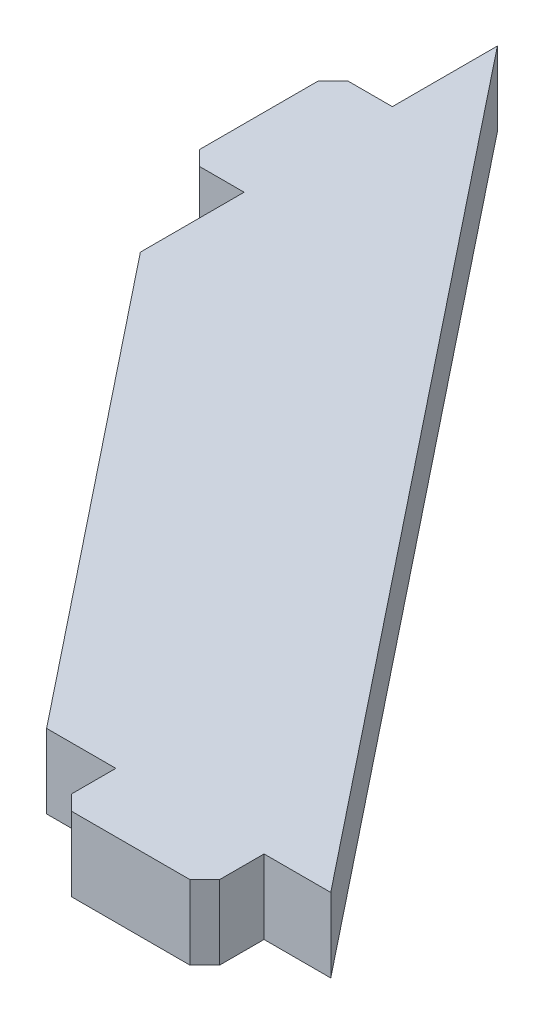
ISO-10303-21;
HEADER;
FILE_DESCRIPTION(('STEP AP214'),'2;1');
FILE_NAME('part.step','',(''),(''),'','','');
FILE_SCHEMA(('AUTOMOTIVE_DESIGN { 1 0 10303 214 1 1 1 1 }'));
ENDSEC;
DATA;
#1=APPLICATION_CONTEXT('core data for automotive mechanical design processes');
#2=APPLICATION_PROTOCOL_DEFINITION('international standard','automotive_design',2000,#1);
#3=PRODUCT_CONTEXT('',#1,'mechanical');
#4=PRODUCT('Part','Part','',(#3));
#5=PRODUCT_RELATED_PRODUCT_CATEGORY('part','',(#4));
#6=PRODUCT_DEFINITION_FORMATION('','',#4);
#7=PRODUCT_DEFINITION_CONTEXT('part definition',#1,'design');
#8=PRODUCT_DEFINITION('design','',#6,#7);
#9=PRODUCT_DEFINITION_SHAPE('','',#8);
#10=(LENGTH_UNIT() NAMED_UNIT(*) SI_UNIT(.MILLI.,.METRE.));
#11=(NAMED_UNIT(*) PLANE_ANGLE_UNIT() SI_UNIT($,.RADIAN.));
#12=(NAMED_UNIT(*) SI_UNIT($,.STERADIAN.) SOLID_ANGLE_UNIT());
#13=UNCERTAINTY_MEASURE_WITH_UNIT(LENGTH_MEASURE(1.E-05),#10,'distance_accuracy_value','');
#14=(GEOMETRIC_REPRESENTATION_CONTEXT(3) GLOBAL_UNCERTAINTY_ASSIGNED_CONTEXT((#13)) GLOBAL_UNIT_ASSIGNED_CONTEXT((#10,
#11,#12)) REPRESENTATION_CONTEXT('',''));
#15=CARTESIAN_POINT('',(0.,0.,0.));
#16=DIRECTION('',(0.,0.,1.));
#17=DIRECTION('',(1.,0.,0.));
#18=AXIS2_PLACEMENT_3D('',#15,#16,#17);
#19=CARTESIAN_POINT('',(-58.5,22.4999999999997,-9.34090909090911));
#20=DIRECTION('',(1.,0.,0.));
#21=DIRECTION('',(0.,0.,1.));
#22=AXIS2_PLACEMENT_3D('',#19,#20,#21);
#23=PLANE('',#22);
#24=DIRECTION('',(0.,0.,1.));
#25=VECTOR('',#24,1.);
#26=CARTESIAN_POINT('',(-58.5,22.4999999999997,-9.34090909090911));
#27=LINE('',#26,#25);
#28=CARTESIAN_POINT('',(-58.5000000000003,22.5,-75.9806956016062));
#29=VERTEX_POINT('',#28);
#30=CARTESIAN_POINT('',(-58.5000000000004,22.5,-61.9806956016062));
#31=VERTEX_POINT('',#30);
#32=EDGE_CURVE('E178',#29,#31,#27,.T.);
#33=ORIENTED_EDGE('',*,*,#32,.F.);
#34=CARTESIAN_POINT('',(-58.5000000000003,22.5,-75.9806956016062));
#35=CARTESIAN_POINT('',(-58.5000000000003,12.5,-75.9806956016062));
#36=B_SPLINE_CURVE_WITH_KNOTS('',1,(#34,#35),.UNSPECIFIED.,.F.,.F.,(2,2),(0.,0.166666666666667),.UNSPECIFIED.);
#37=CARTESIAN_POINT('',(-58.5000000000003,12.5,-75.9806956016062));
#38=VERTEX_POINT('',#37);
#39=EDGE_CURVE('E163',#29,#38,#36,.T.);
#40=ORIENTED_EDGE('',*,*,#39,.T.);
#41=DIRECTION('',(0.,0.,1.));
#42=VECTOR('',#41,1.);
#43=CARTESIAN_POINT('',(-58.5000000000003,12.4999999999997,-9.34090909090941));
#44=LINE('',#43,#42);
#45=CARTESIAN_POINT('',(-58.5000000000003,12.5,-61.9806956016063));
#46=VERTEX_POINT('',#45);
#47=EDGE_CURVE('E176',#38,#46,#44,.T.);
#48=ORIENTED_EDGE('',*,*,#47,.T.);
#49=DIRECTION('',(0.,1.,0.));
#50=VECTOR('',#49,1.);
#51=CARTESIAN_POINT('',(-58.5000000000004,22.5,-61.9806956016062));
#52=LINE('',#51,#50);
#53=EDGE_CURVE('E48',#46,#31,#52,.T.);
#54=ORIENTED_EDGE('',*,*,#53,.T.);
#55=EDGE_LOOP('',(#33,#40,#48,#54));
#56=FACE_BOUND('',#55,.T.);
#57=ADVANCED_FACE('F44',(#56),#23,.F.);
#58=CARTESIAN_POINT('',(-58.5000000000003,12.5,-110.155878083358));
#59=VERTEX_POINT('',#58);
#60=CARTESIAN_POINT('',(-58.5000000000002,12.5,-95.9806956016062));
#61=VERTEX_POINT('',#60);
#62=EDGE_CURVE('E188',#59,#61,#44,.T.);
#63=ORIENTED_EDGE('',*,*,#62,.T.);
#64=CARTESIAN_POINT('',(-58.5000000000002,12.5,-95.9806956016062));
#65=CARTESIAN_POINT('',(-58.5000000000002,22.5,-95.9806956016062));
#66=B_SPLINE_CURVE_WITH_KNOTS('',1,(#64,#65),.UNSPECIFIED.,.F.,.F.,(2,2),(0.5,
0.666666666666667),.UNSPECIFIED.);
#67=CARTESIAN_POINT('',(-58.5000000000003,22.5,-95.9806956016062));
#68=VERTEX_POINT('',#67);
#69=EDGE_CURVE('E172',#61,#68,#66,.T.);
#70=ORIENTED_EDGE('',*,*,#69,.T.);
#71=CARTESIAN_POINT('',(-58.5000000000004,22.5,-110.155878083358));
#72=VERTEX_POINT('',#71);
#73=EDGE_CURVE('E244',#72,#68,#27,.T.);
#74=ORIENTED_EDGE('',*,*,#73,.F.);
#75=DIRECTION('',(0.,1.,0.));
#76=VECTOR('',#75,1.);
#77=CARTESIAN_POINT('',(-58.5000000000004,22.5,-110.155878083358));
#78=LINE('',#77,#76);
#79=EDGE_CURVE('E211',#59,#72,#78,.T.);
#80=ORIENTED_EDGE('',*,*,#79,.F.);
#81=EDGE_LOOP('',(#63,#70,#74,#80));
#82=FACE_BOUND('',#81,.T.);
#83=ADVANCED_FACE('F375',(#82),#23,.F.);
#84=CARTESIAN_POINT('',(21.7365845694295,22.5,0.));
#85=DIRECTION('',(0.,0.,-1.));
#86=DIRECTION('',(1.,0.,0.));
#87=AXIS2_PLACEMENT_3D('',#84,#85,#86);
#88=PLANE('',#87);
#89=CARTESIAN_POINT('',(20.1708242435421,12.5,0.));
#90=CARTESIAN_POINT('',(20.1708242435421,22.5,0.));
#91=B_SPLINE_CURVE_WITH_KNOTS('',1,(#89,#90),.UNSPECIFIED.,.F.,.F.,(2,2),(0.,0.166666666666667),.UNSPECIFIED.);
#92=CARTESIAN_POINT('',(20.1708242435421,12.5,0.));
#93=VERTEX_POINT('',#92);
#94=CARTESIAN_POINT('',(20.1708242435421,22.5,0.));
#95=VERTEX_POINT('',#94);
#96=EDGE_CURVE('E274',#93,#95,#91,.T.);
#97=ORIENTED_EDGE('',*,*,#96,.F.);
#98=DIRECTION('',(1.,0.,0.));
#99=VECTOR('',#98,1.);
#100=CARTESIAN_POINT('',(21.7365845694295,12.5,0.));
#101=LINE('',#100,#99);
#102=CARTESIAN_POINT('',(29.1708242435421,12.5,0.));
#103=VERTEX_POINT('',#102);
#104=EDGE_CURVE('E208',#93,#103,#101,.T.);
#105=ORIENTED_EDGE('',*,*,#104,.T.);
#106=DIRECTION('',(0.,1.,0.));
#107=VECTOR('',#106,1.);
#108=CARTESIAN_POINT('',(29.1708242435421,22.5000000000004,0.));
#109=LINE('',#108,#107);
#110=CARTESIAN_POINT('',(29.1708242435421,22.5000000000004,0.));
#111=VERTEX_POINT('',#110);
#112=EDGE_CURVE('E54',#103,#111,#109,.T.);
#113=ORIENTED_EDGE('',*,*,#112,.T.);
#114=DIRECTION('',(1.,0.,0.));
#115=VECTOR('',#114,1.);
#116=CARTESIAN_POINT('',(21.7365845694295,22.5,0.));
#117=LINE('',#116,#115);
#118=EDGE_CURVE('E69',#95,#111,#117,.T.);
#119=ORIENTED_EDGE('',*,*,#118,.F.);
#120=EDGE_LOOP('',(#97,#105,#113,#119));
#121=FACE_BOUND('',#120,.T.);
#122=ADVANCED_FACE('F219',(#121),#88,.F.);
#123=CARTESIAN_POINT('',(0.170824243542117,22.5,0.));
#124=CARTESIAN_POINT('',(0.170824243542117,12.5,0.));
#125=B_SPLINE_CURVE_WITH_KNOTS('',1,(#123,#124),.UNSPECIFIED.,.F.,.F.,(2,2),(0.5,
0.666666666666667),.UNSPECIFIED.);
#126=CARTESIAN_POINT('',(0.170824243542117,22.5,0.));
#127=VERTEX_POINT('',#126);
#128=CARTESIAN_POINT('',(0.170824243542117,12.5,0.));
#129=VERTEX_POINT('',#128);
#130=EDGE_CURVE('E280',#127,#129,#125,.T.);
#131=ORIENTED_EDGE('',*,*,#130,.F.);
#132=CARTESIAN_POINT('',(-9.17082424354204,22.5000000000004,0.));
#133=VERTEX_POINT('',#132);
#134=EDGE_CURVE('E228',#133,#127,#117,.T.);
#135=ORIENTED_EDGE('',*,*,#134,.F.);
#136=DIRECTION('',(0.,1.,0.));
#137=VECTOR('',#136,1.);
#138=CARTESIAN_POINT('',(-9.17082424354204,22.5000000000004,0.));
#139=LINE('',#138,#137);
#140=CARTESIAN_POINT('',(-9.17082424354204,12.5,0.));
#141=VERTEX_POINT('',#140);
#142=EDGE_CURVE('E11',#141,#133,#139,.T.);
#143=ORIENTED_EDGE('',*,*,#142,.F.);
#144=EDGE_CURVE('E205',#141,#129,#101,.T.);
#145=ORIENTED_EDGE('',*,*,#144,.T.);
#146=EDGE_LOOP('',(#131,#135,#143,#145));
#147=FACE_BOUND('',#146,.T.);
#148=ADVANCED_FACE('F398',(#147),#88,.F.);
#149=CARTESIAN_POINT('',(21.7365845694295,22.5,-9.34090909090921));
#150=DIRECTION('',(-0.782438971295297,0.,0.622727272727281));
#151=DIRECTION('',(-0.622727272727281,0.,-0.782438971295297));
#152=AXIS2_PLACEMENT_3D('',#149,#150,#151);
#153=PLANE('',#152);
#154=ORIENTED_EDGE('',*,*,#112,.F.);
#155=DIRECTION('',(-0.622727272727281,0.,-0.782438971295297));
#156=VECTOR('',#155,1.);
#157=CARTESIAN_POINT('',(21.7365845694295,12.5,-9.34090909090923));
#158=LINE('',#157,#156);
#159=EDGE_CURVE('E201',#103,#59,#158,.T.);
#160=ORIENTED_EDGE('',*,*,#159,.T.);
#161=ORIENTED_EDGE('',*,*,#79,.T.);
#162=DIRECTION('',(-0.622727272727281,0.,-0.782438971295297));
#163=VECTOR('',#162,1.);
#164=CARTESIAN_POINT('',(21.7365845694295,22.5,-9.34090909090921));
#165=LINE('',#164,#163);
#166=EDGE_CURVE('E199',#111,#72,#165,.T.);
#167=ORIENTED_EDGE('',*,*,#166,.F.);
#168=EDGE_LOOP('',(#154,#160,#161,#167));
#169=FACE_BOUND('',#168,.T.);
#170=ADVANCED_FACE('F224',(#169),#153,.F.);
#171=CARTESIAN_POINT('',(-1.73658456942943,22.5,9.34090909090922));
#172=DIRECTION('',(-0.782438971295297,0.,0.622727272727281));
#173=DIRECTION('',(-0.622727272727281,0.,-0.782438971295297));
#174=AXIS2_PLACEMENT_3D('',#171,#172,#173);
#175=PLANE('',#174);
#176=DIRECTION('',(-0.622727272727281,0.,-0.782438971295297));
#177=VECTOR('',#176,1.);
#178=CARTESIAN_POINT('',(-1.7365845694294,12.5,9.34090909090919));
#179=LINE('',#178,#177);
#180=EDGE_CURVE('E186',#141,#46,#179,.T.);
#181=ORIENTED_EDGE('',*,*,#180,.F.);
#182=ORIENTED_EDGE('',*,*,#142,.T.);
#183=DIRECTION('',(-0.622727272727281,0.,-0.782438971295297));
#184=VECTOR('',#183,1.);
#185=CARTESIAN_POINT('',(-1.73658456942943,22.5,9.34090909090922));
#186=LINE('',#185,#184);
#187=EDGE_CURVE('E239',#133,#31,#186,.T.);
#188=ORIENTED_EDGE('',*,*,#187,.T.);
#189=ORIENTED_EDGE('',*,*,#53,.F.);
#190=EDGE_LOOP('',(#181,#182,#188,#189));
#191=FACE_BOUND('',#190,.T.);
#192=ADVANCED_FACE('F46',(#191),#175,.T.);
#193=CARTESIAN_POINT('',(21.7365845694295,22.5,-9.34090909090921));
#194=DIRECTION('',(0.,-1.,0.));
#195=DIRECTION('',(1.,0.,0.));
#196=AXIS2_PLACEMENT_3D('',#193,#194,#195);
#197=PLANE('',#196);
#198=ORIENTED_EDGE('',*,*,#73,.T.);
#199=DIRECTION('',(1.,0.,0.));
#200=VECTOR('',#199,1.);
#201=CARTESIAN_POINT('',(-74.5000000000003,22.5,-95.9806956016062));
#202=LINE('',#201,#200);
#203=CARTESIAN_POINT('',(-64.5000000000003,22.5,-95.9806956016062));
#204=VERTEX_POINT('',#203);
#205=EDGE_CURVE('E61',#204,#68,#202,.T.);
#206=ORIENTED_EDGE('',*,*,#205,.F.);
#207=DIRECTION('',(-0.707106781186545,0.,0.70710678118655));
#208=VECTOR('',#207,1.);
#209=CARTESIAN_POINT('',(-69.5000000000003,22.5,-90.9806956016062));
#210=LINE('',#209,#208);
#211=CARTESIAN_POINT('',(-66.5000000000003,22.5,-93.9806956016062));
#212=VERTEX_POINT('',#211);
#213=EDGE_CURVE('E311',#204,#212,#210,.T.);
#214=ORIENTED_EDGE('',*,*,#213,.T.);
#215=DIRECTION('',(0.,0.,-1.));
#216=VECTOR('',#215,1.);
#217=CARTESIAN_POINT('',(-66.5000000000003,22.5,-95.9806956016062));
#218=LINE('',#217,#216);
#219=CARTESIAN_POINT('',(-66.5000000000003,22.5,-77.9806956016062));
#220=VERTEX_POINT('',#219);
#221=EDGE_CURVE('E337',#220,#212,#218,.T.);
#222=ORIENTED_EDGE('',*,*,#221,.F.);
#223=DIRECTION('',(0.707106781186548,0.,0.707106781186548));
#224=VECTOR('',#223,1.);
#225=CARTESIAN_POINT('',(-79.5000000000003,22.5,-90.9806956016062));
#226=LINE('',#225,#224);
#227=CARTESIAN_POINT('',(-64.5000000000002,22.5,-75.9806956016062));
#228=VERTEX_POINT('',#227);
#229=EDGE_CURVE('E314',#220,#228,#226,.T.);
#230=ORIENTED_EDGE('',*,*,#229,.T.);
#231=DIRECTION('',(1.,0.,0.));
#232=VECTOR('',#231,1.);
#233=CARTESIAN_POINT('',(-74.5000000000003,22.5,-75.9806956016062));
#234=LINE('',#233,#232);
#235=EDGE_CURVE('E343',#228,#29,#234,.T.);
#236=ORIENTED_EDGE('',*,*,#235,.T.);
#237=ORIENTED_EDGE('',*,*,#32,.T.);
#238=ORIENTED_EDGE('',*,*,#187,.F.);
#239=ORIENTED_EDGE('',*,*,#134,.T.);
#240=DIRECTION('',(0.,0.,-1.));
#241=VECTOR('',#240,1.);
#242=CARTESIAN_POINT('',(0.170824243542127,22.5,16.));
#243=LINE('',#242,#241);
#244=CARTESIAN_POINT('',(0.170824243542121,22.5,6.));
#245=VERTEX_POINT('',#244);
#246=EDGE_CURVE('E281',#245,#127,#243,.T.);
#247=ORIENTED_EDGE('',*,*,#246,.F.);
#248=DIRECTION('',(0.707106781186548,0.,0.707106781186548));
#249=VECTOR('',#248,1.);
#250=CARTESIAN_POINT('',(2.17082424354215,22.5,8.00000000000005));
#251=LINE('',#250,#249);
#252=CARTESIAN_POINT('',(2.17082424354212,22.5,8.00000000000003));
#253=VERTEX_POINT('',#252);
#254=EDGE_CURVE('E195',#245,#253,#251,.T.);
#255=ORIENTED_EDGE('',*,*,#254,.T.);
#256=DIRECTION('',(-1.,0.,0.));
#257=VECTOR('',#256,1.);
#258=CARTESIAN_POINT('',(20.1708242435421,22.5,8.00000000000004));
#259=LINE('',#258,#257);
#260=CARTESIAN_POINT('',(18.1708242435421,22.5,8.00000000000003));
#261=VERTEX_POINT('',#260);
#262=EDGE_CURVE('E269',#261,#253,#259,.T.);
#263=ORIENTED_EDGE('',*,*,#262,.F.);
#264=DIRECTION('',(0.707106781186548,0.,-0.707106781186547));
#265=VECTOR('',#264,1.);
#266=CARTESIAN_POINT('',(18.1708242435421,22.5,8.00000000000005));
#267=LINE('',#266,#265);
#268=CARTESIAN_POINT('',(20.1708242435421,22.5,6.));
#269=VERTEX_POINT('',#268);
#270=EDGE_CURVE('E249',#261,#269,#267,.T.);
#271=ORIENTED_EDGE('',*,*,#270,.T.);
#272=DIRECTION('',(0.,0.,-1.));
#273=VECTOR('',#272,1.);
#274=CARTESIAN_POINT('',(20.1708242435421,22.5,16.));
#275=LINE('',#274,#273);
#276=EDGE_CURVE('E284',#269,#95,#275,.T.);
#277=ORIENTED_EDGE('',*,*,#276,.T.);
#278=ORIENTED_EDGE('',*,*,#118,.T.);
#279=ORIENTED_EDGE('',*,*,#166,.T.);
#280=EDGE_LOOP('',(#198,#206,#214,#222,#230,#236,#237,#238,#239,#247,#255,#263,#271,#277,#278,#279));
#281=FACE_BOUND('',#280,.T.);
#282=ADVANCED_FACE('F400',(#281),#197,.F.);
#283=CARTESIAN_POINT('',(21.7365845694295,12.5,-9.34090909090923));
#284=DIRECTION('',(0.,-1.,0.));
#285=DIRECTION('',(1.,0.,0.));
#286=AXIS2_PLACEMENT_3D('',#283,#284,#285);
#287=PLANE('',#286);
#288=ORIENTED_EDGE('',*,*,#62,.F.);
#289=ORIENTED_EDGE('',*,*,#159,.F.);
#290=ORIENTED_EDGE('',*,*,#104,.F.);
#291=DIRECTION('',(0.,0.,-1.));
#292=VECTOR('',#291,1.);
#293=CARTESIAN_POINT('',(20.1708242435421,12.5,16.));
#294=LINE('',#293,#292);
#295=CARTESIAN_POINT('',(20.1708242435421,12.5,6.));
#296=VERTEX_POINT('',#295);
#297=EDGE_CURVE('E270',#296,#93,#294,.T.);
#298=ORIENTED_EDGE('',*,*,#297,.F.);
#299=DIRECTION('',(-0.707106781186548,0.,0.707106781186547));
#300=VECTOR('',#299,1.);
#301=CARTESIAN_POINT('',(18.1708242435421,12.5,8.00000000000004));
#302=LINE('',#301,#300);
#303=CARTESIAN_POINT('',(18.1708242435421,12.5,8.00000000000003));
#304=VERTEX_POINT('',#303);
#305=EDGE_CURVE('E258',#296,#304,#302,.T.);
#306=ORIENTED_EDGE('',*,*,#305,.T.);
#307=DIRECTION('',(1.,0.,0.));
#308=VECTOR('',#307,1.);
#309=CARTESIAN_POINT('',(0.170824243542123,12.5,8.));
#310=LINE('',#309,#308);
#311=CARTESIAN_POINT('',(2.17082424354212,12.5,8.00000000000003));
#312=VERTEX_POINT('',#311);
#313=EDGE_CURVE('E279',#312,#304,#310,.T.);
#314=ORIENTED_EDGE('',*,*,#313,.F.);
#315=DIRECTION('',(-0.707106781186548,0.,-0.707106781186548));
#316=VECTOR('',#315,1.);
#317=CARTESIAN_POINT('',(2.17082424354212,12.5,8.00000000000004));
#318=LINE('',#317,#316);
#319=CARTESIAN_POINT('',(0.170824243542121,12.5,6.));
#320=VERTEX_POINT('',#319);
#321=EDGE_CURVE('E255',#312,#320,#318,.T.);
#322=ORIENTED_EDGE('',*,*,#321,.T.);
#323=DIRECTION('',(0.,0.,-1.));
#324=VECTOR('',#323,1.);
#325=CARTESIAN_POINT('',(0.170824243542127,12.5,16.));
#326=LINE('',#325,#324);
#327=EDGE_CURVE('E275',#320,#129,#326,.T.);
#328=ORIENTED_EDGE('',*,*,#327,.T.);
#329=ORIENTED_EDGE('',*,*,#144,.F.);
#330=ORIENTED_EDGE('',*,*,#180,.T.);
#331=ORIENTED_EDGE('',*,*,#47,.F.);
#332=DIRECTION('',(1.,0.,0.));
#333=VECTOR('',#332,1.);
#334=CARTESIAN_POINT('',(-74.5000000000003,12.5,-75.9806956016062));
#335=LINE('',#334,#333);
#336=CARTESIAN_POINT('',(-64.5000000000002,12.5,-75.9806956016062));
#337=VERTEX_POINT('',#336);
#338=EDGE_CURVE('E159',#337,#38,#335,.T.);
#339=ORIENTED_EDGE('',*,*,#338,.F.);
#340=DIRECTION('',(-0.707106781186548,0.,-0.707106781186548));
#341=VECTOR('',#340,1.);
#342=CARTESIAN_POINT('',(-69.5000000000003,12.5,-80.9806956016062));
#343=LINE('',#342,#341);
#344=CARTESIAN_POINT('',(-66.5000000000003,12.5,-77.9806956016062));
#345=VERTEX_POINT('',#344);
#346=EDGE_CURVE('E323',#337,#345,#343,.T.);
#347=ORIENTED_EDGE('',*,*,#346,.T.);
#348=DIRECTION('',(0.,0.,1.));
#349=VECTOR('',#348,1.);
#350=CARTESIAN_POINT('',(-66.5000000000002,12.5,-75.9806956016062));
#351=LINE('',#350,#349);
#352=CARTESIAN_POINT('',(-66.5000000000003,12.5,-93.9806956016062));
#353=VERTEX_POINT('',#352);
#354=EDGE_CURVE('E334',#353,#345,#351,.T.);
#355=ORIENTED_EDGE('',*,*,#354,.F.);
#356=DIRECTION('',(0.707106781186545,0.,-0.70710678118655));
#357=VECTOR('',#356,1.);
#358=CARTESIAN_POINT('',(-79.5000000000003,12.5,-80.9806956016061));
#359=LINE('',#358,#357);
#360=CARTESIAN_POINT('',(-64.5000000000003,12.5,-95.9806956016062));
#361=VERTEX_POINT('',#360);
#362=EDGE_CURVE('E320',#353,#361,#359,.T.);
#363=ORIENTED_EDGE('',*,*,#362,.T.);
#364=DIRECTION('',(1.,0.,0.));
#365=VECTOR('',#364,1.);
#366=CARTESIAN_POINT('',(-74.5000000000003,12.5,-95.9806956016062));
#367=LINE('',#366,#365);
#368=EDGE_CURVE('E171',#361,#61,#367,.T.);
#369=ORIENTED_EDGE('',*,*,#368,.T.);
#370=EDGE_LOOP('',(#288,#289,#290,#298,#306,#314,#322,#328,#329,#330,#331,#339,#347,#355,#363,#369));
#371=FACE_BOUND('',#370,.T.);
#372=ADVANCED_FACE('F183',(#371),#287,.T.);
#373=CARTESIAN_POINT('',(20.1708242435421,12.5,16.));
#374=DIRECTION('',(-1.,0.,0.));
#375=DIRECTION('',(0.,0.,1.));
#376=AXIS2_PLACEMENT_3D('',#373,#374,#375);
#377=PLANE('',#376);
#378=ORIENTED_EDGE('',*,*,#276,.F.);
#379=DIRECTION('',(0.,-1.,0.));
#380=VECTOR('',#379,1.);
#381=CARTESIAN_POINT('',(20.1708242435421,12.5,6.));
#382=LINE('',#381,#380);
#383=EDGE_CURVE('E189',#269,#296,#382,.T.);
#384=ORIENTED_EDGE('',*,*,#383,.T.);
#385=ORIENTED_EDGE('',*,*,#297,.T.);
#386=ORIENTED_EDGE('',*,*,#96,.T.);
#387=EDGE_LOOP('',(#378,#384,#385,#386));
#388=FACE_BOUND('',#387,.T.);
#389=ADVANCED_FACE('F380',(#388),#377,.F.);
#390=CARTESIAN_POINT('',(0.170824243542127,22.5,16.));
#391=DIRECTION('',(1.,0.,0.));
#392=DIRECTION('',(0.,0.,-1.));
#393=AXIS2_PLACEMENT_3D('',#390,#391,#392);
#394=PLANE('',#393);
#395=ORIENTED_EDGE('',*,*,#327,.F.);
#396=DIRECTION('',(0.,1.,0.));
#397=VECTOR('',#396,1.);
#398=CARTESIAN_POINT('',(0.170824243542121,22.5,6.));
#399=LINE('',#398,#397);
#400=EDGE_CURVE('E252',#320,#245,#399,.T.);
#401=ORIENTED_EDGE('',*,*,#400,.T.);
#402=ORIENTED_EDGE('',*,*,#246,.T.);
#403=ORIENTED_EDGE('',*,*,#130,.T.);
#404=EDGE_LOOP('',(#395,#401,#402,#403));
#405=FACE_BOUND('',#404,.T.);
#406=ADVANCED_FACE('F396',(#405),#394,.F.);
#407=CARTESIAN_POINT('',(0.,0.,8.));
#408=DIRECTION('',(0.,0.,1.));
#409=DIRECTION('',(1.,0.,0.));
#410=AXIS2_PLACEMENT_3D('',#407,#408,#409);
#411=PLANE('',#410);
#412=ORIENTED_EDGE('',*,*,#262,.T.);
#413=DIRECTION('',(0.,-1.,0.));
#414=VECTOR('',#413,1.);
#415=CARTESIAN_POINT('',(2.17082424354212,12.5,8.00000000000003));
#416=LINE('',#415,#414);
#417=EDGE_CURVE('E261',#253,#312,#416,.T.);
#418=ORIENTED_EDGE('',*,*,#417,.T.);
#419=ORIENTED_EDGE('',*,*,#313,.T.);
#420=DIRECTION('',(0.,1.,0.));
#421=VECTOR('',#420,1.);
#422=CARTESIAN_POINT('',(18.1708242435421,22.5,8.00000000000003));
#423=LINE('',#422,#421);
#424=EDGE_CURVE('E265',#304,#261,#423,.T.);
#425=ORIENTED_EDGE('',*,*,#424,.T.);
#426=EDGE_LOOP('',(#412,#418,#419,#425));
#427=FACE_BOUND('',#426,.T.);
#428=ADVANCED_FACE('F387',(#427),#411,.T.);
#429=CARTESIAN_POINT('',(2.17082424354212,0.,8.00000000000003));
#430=DIRECTION('',(-0.707106781186548,0.,0.707106781186548));
#431=DIRECTION('',(0.,1.,0.));
#432=AXIS2_PLACEMENT_3D('',#429,#430,#431);
#433=PLANE('',#432);
#434=ORIENTED_EDGE('',*,*,#254,.F.);
#435=ORIENTED_EDGE('',*,*,#400,.F.);
#436=ORIENTED_EDGE('',*,*,#321,.F.);
#437=ORIENTED_EDGE('',*,*,#417,.F.);
#438=EDGE_LOOP('',(#434,#435,#436,#437));
#439=FACE_BOUND('',#438,.T.);
#440=ADVANCED_FACE('F392',(#439),#433,.T.);
#441=CARTESIAN_POINT('',(18.1708242435421,0.,8.00000000000003));
#442=DIRECTION('',(0.707106781186547,0.,0.707106781186548));
#443=DIRECTION('',(0.,-1.,0.));
#444=AXIS2_PLACEMENT_3D('',#441,#442,#443);
#445=PLANE('',#444);
#446=ORIENTED_EDGE('',*,*,#305,.F.);
#447=ORIENTED_EDGE('',*,*,#383,.F.);
#448=ORIENTED_EDGE('',*,*,#270,.F.);
#449=ORIENTED_EDGE('',*,*,#424,.F.);
#450=EDGE_LOOP('',(#446,#447,#448,#449));
#451=FACE_BOUND('',#450,.T.);
#452=ADVANCED_FACE('F383',(#451),#445,.T.);
#453=CARTESIAN_POINT('',(-74.5000000000003,22.5,-75.9806956016062));
#454=DIRECTION('',(0.,0.,1.));
#455=DIRECTION('',(1.,0.,0.));
#456=AXIS2_PLACEMENT_3D('',#453,#454,#455);
#457=PLANE('',#456);
#458=ORIENTED_EDGE('',*,*,#235,.F.);
#459=DIRECTION('',(0.,-1.,0.));
#460=VECTOR('',#459,1.);
#461=CARTESIAN_POINT('',(-64.5000000000002,12.5,-75.9806956016062));
#462=LINE('',#461,#460);
#463=EDGE_CURVE('E166',#228,#337,#462,.T.);
#464=ORIENTED_EDGE('',*,*,#463,.T.);
#465=ORIENTED_EDGE('',*,*,#338,.T.);
#466=ORIENTED_EDGE('',*,*,#39,.F.);
#467=EDGE_LOOP('',(#458,#464,#465,#466));
#468=FACE_BOUND('',#467,.T.);
#469=ADVANCED_FACE('F162',(#468),#457,.T.);
#470=CARTESIAN_POINT('',(-74.5000000000003,12.5,-95.9806956016062));
#471=DIRECTION('',(0.,0.,-1.));
#472=DIRECTION('',(-1.,0.,0.));
#473=AXIS2_PLACEMENT_3D('',#470,#471,#472);
#474=PLANE('',#473);
#475=ORIENTED_EDGE('',*,*,#368,.F.);
#476=DIRECTION('',(0.,1.,0.));
#477=VECTOR('',#476,1.);
#478=CARTESIAN_POINT('',(-64.5000000000003,22.5,-95.9806956016062));
#479=LINE('',#478,#477);
#480=EDGE_CURVE('E317',#361,#204,#479,.T.);
#481=ORIENTED_EDGE('',*,*,#480,.T.);
#482=ORIENTED_EDGE('',*,*,#205,.T.);
#483=ORIENTED_EDGE('',*,*,#69,.F.);
#484=EDGE_LOOP('',(#475,#481,#482,#483));
#485=FACE_BOUND('',#484,.T.);
#486=ADVANCED_FACE('F373',(#485),#474,.T.);
#487=CARTESIAN_POINT('',(-66.4999999999999,0.,0.));
#488=DIRECTION('',(1.,0.,0.));
#489=DIRECTION('',(0.,0.,-1.));
#490=AXIS2_PLACEMENT_3D('',#487,#488,#489);
#491=PLANE('',#490);
#492=ORIENTED_EDGE('',*,*,#221,.T.);
#493=DIRECTION('',(0.,-1.,0.));
#494=VECTOR('',#493,1.);
#495=CARTESIAN_POINT('',(-66.5000000000003,12.5,-93.9806956016062));
#496=LINE('',#495,#494);
#497=EDGE_CURVE('E326',#212,#353,#496,.T.);
#498=ORIENTED_EDGE('',*,*,#497,.T.);
#499=ORIENTED_EDGE('',*,*,#354,.T.);
#500=DIRECTION('',(0.,1.,0.));
#501=VECTOR('',#500,1.);
#502=CARTESIAN_POINT('',(-66.5000000000002,22.5,-77.9806956016062));
#503=LINE('',#502,#501);
#504=EDGE_CURVE('E330',#345,#220,#503,.T.);
#505=ORIENTED_EDGE('',*,*,#504,.T.);
#506=EDGE_LOOP('',(#492,#498,#499,#505));
#507=FACE_BOUND('',#506,.T.);
#508=ADVANCED_FACE('F365',(#507),#491,.F.);
#509=CARTESIAN_POINT('',(-66.5000000000003,0.,-93.9806956016062));
#510=DIRECTION('',(-0.70710678118655,0.,-0.707106781186545));
#511=DIRECTION('',(0.,1.,0.));
#512=AXIS2_PLACEMENT_3D('',#509,#510,#511);
#513=PLANE('',#512);
#514=ORIENTED_EDGE('',*,*,#213,.F.);
#515=ORIENTED_EDGE('',*,*,#480,.F.);
#516=ORIENTED_EDGE('',*,*,#362,.F.);
#517=ORIENTED_EDGE('',*,*,#497,.F.);
#518=EDGE_LOOP('',(#514,#515,#516,#517));
#519=FACE_BOUND('',#518,.T.);
#520=ADVANCED_FACE('F370',(#519),#513,.T.);
#521=CARTESIAN_POINT('',(-66.5000000000002,0.,-77.9806956016062));
#522=DIRECTION('',(-0.707106781186547,0.,0.707106781186547));
#523=DIRECTION('',(0.,-1.,0.));
#524=AXIS2_PLACEMENT_3D('',#521,#522,#523);
#525=PLANE('',#524);
#526=ORIENTED_EDGE('',*,*,#346,.F.);
#527=ORIENTED_EDGE('',*,*,#463,.F.);
#528=ORIENTED_EDGE('',*,*,#229,.F.);
#529=ORIENTED_EDGE('',*,*,#504,.F.);
#530=EDGE_LOOP('',(#526,#527,#528,#529));
#531=FACE_BOUND('',#530,.T.);
#532=ADVANCED_FACE('F405',(#531),#525,.T.);
#533=CLOSED_SHELL('',(#57,#83,#122,#148,#170,#192,#282,#372,#389,#406,#428,#440,#452,#469,#486,
#508,#520,#532));
#534=MANIFOLD_SOLID_BREP('B2',#533);
#535=ADVANCED_BREP_SHAPE_REPRESENTATION('',(#18,#534),#14);
#536=SHAPE_DEFINITION_REPRESENTATION(#9,#535);
ENDSEC;
END-ISO-10303-21;
